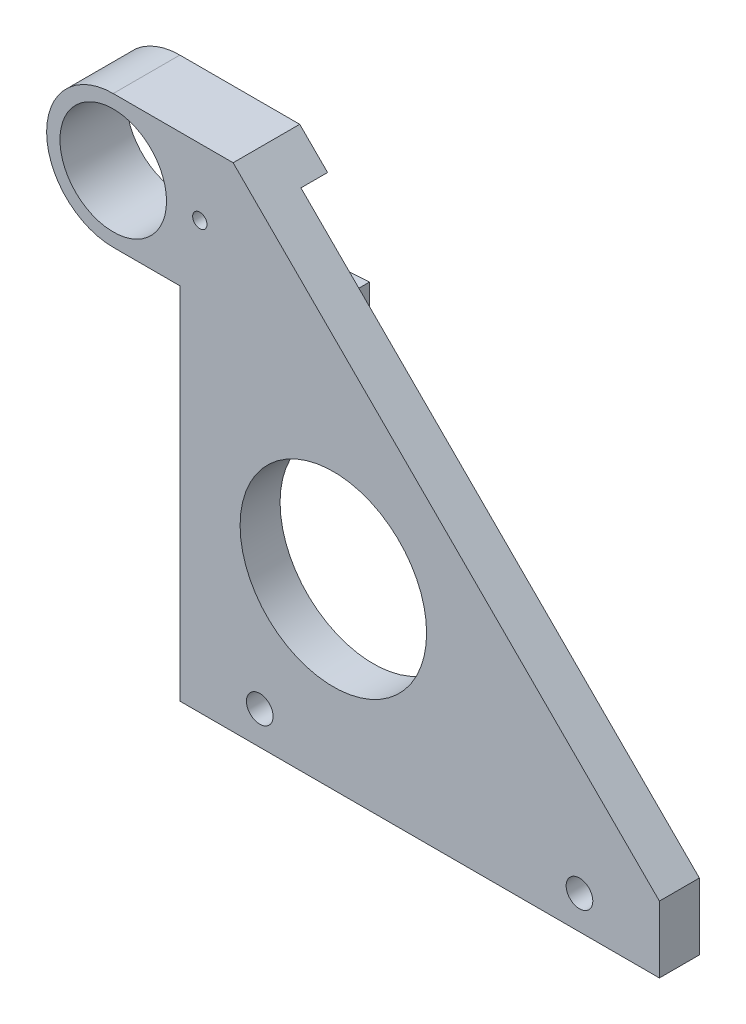
ISO-10303-21;
HEADER;
FILE_DESCRIPTION(('STEP AP214'),'2;1');
FILE_NAME('part.step','',(''),(''),'','','');
FILE_SCHEMA(('AUTOMOTIVE_DESIGN { 1 0 10303 214 1 1 1 1 }'));
ENDSEC;
DATA;
#1=APPLICATION_CONTEXT('core data for automotive mechanical design processes');
#2=APPLICATION_PROTOCOL_DEFINITION('international standard','automotive_design',2000,#1);
#3=PRODUCT_CONTEXT('',#1,'mechanical');
#4=PRODUCT('Part','Part','',(#3));
#5=PRODUCT_RELATED_PRODUCT_CATEGORY('part','',(#4));
#6=PRODUCT_DEFINITION_FORMATION('','',#4);
#7=PRODUCT_DEFINITION_CONTEXT('part definition',#1,'design');
#8=PRODUCT_DEFINITION('design','',#6,#7);
#9=PRODUCT_DEFINITION_SHAPE('','',#8);
#10=(LENGTH_UNIT() NAMED_UNIT(*) SI_UNIT(.MILLI.,.METRE.));
#11=(NAMED_UNIT(*) PLANE_ANGLE_UNIT() SI_UNIT($,.RADIAN.));
#12=(NAMED_UNIT(*) SI_UNIT($,.STERADIAN.) SOLID_ANGLE_UNIT());
#13=UNCERTAINTY_MEASURE_WITH_UNIT(LENGTH_MEASURE(1.E-05),#10,'distance_accuracy_value','');
#14=(GEOMETRIC_REPRESENTATION_CONTEXT(3) GLOBAL_UNCERTAINTY_ASSIGNED_CONTEXT((#13)) GLOBAL_UNIT_ASSIGNED_CONTEXT((#10,
#11,#12)) REPRESENTATION_CONTEXT('',''));
#15=CARTESIAN_POINT('',(0.,0.,0.));
#16=DIRECTION('',(0.,0.,1.));
#17=DIRECTION('',(1.,0.,0.));
#18=AXIS2_PLACEMENT_3D('',#15,#16,#17);
#19=CARTESIAN_POINT('',(12.,2.49999999999995,0.));
#20=DIRECTION('',(0.,0.,1.));
#21=DIRECTION('',(1.,0.,0.));
#22=AXIS2_PLACEMENT_3D('',#19,#20,#21);
#23=CYLINDRICAL_SURFACE('',#22,1.);
#24=CARTESIAN_POINT('',(12.,2.49999999999995,3.));
#25=DIRECTION('',(0.,0.,1.));
#26=DIRECTION('',(1.,0.,0.));
#27=AXIS2_PLACEMENT_3D('',#24,#25,#26);
#28=CIRCLE('',#27,1.);
#29=CARTESIAN_POINT('',(13.,2.49999999999995,3.));
#30=VERTEX_POINT('',#29);
#31=EDGE_CURVE('E178',#30,#30,#28,.T.);
#32=ORIENTED_EDGE('',*,*,#31,.T.);
#33=EDGE_LOOP('',(#32));
#34=FACE_BOUND('',#33,.T.);
#35=CARTESIAN_POINT('',(12.,2.49999999999995,1.5));
#36=DIRECTION('',(0.,0.,-1.));
#37=DIRECTION('',(-1.,0.,0.));
#38=AXIS2_PLACEMENT_3D('',#35,#36,#37);
#39=CIRCLE('',#38,1.);
#40=CARTESIAN_POINT('',(11.,2.49999999999995,1.5));
#41=VERTEX_POINT('',#40);
#42=EDGE_CURVE('E42',#41,#41,#39,.F.);
#43=ORIENTED_EDGE('',*,*,#42,.F.);
#44=EDGE_LOOP('',(#43));
#45=FACE_BOUND('',#44,.T.);
#46=ADVANCED_FACE('F37',(#34,#45),#23,.F.);
#47=CARTESIAN_POINT('',(-12.,2.49999999999995,0.));
#48=DIRECTION('',(0.,0.,1.));
#49=DIRECTION('',(1.,0.,0.));
#50=AXIS2_PLACEMENT_3D('',#47,#48,#49);
#51=CYLINDRICAL_SURFACE('',#50,1.);
#52=CARTESIAN_POINT('',(-12.,2.49999999999995,3.));
#53=DIRECTION('',(0.,0.,1.));
#54=DIRECTION('',(-1.,0.,0.));
#55=AXIS2_PLACEMENT_3D('',#52,#53,#54);
#56=CIRCLE('',#55,1.);
#57=CARTESIAN_POINT('',(-13.,2.49999999999995,3.));
#58=VERTEX_POINT('',#57);
#59=EDGE_CURVE('E175',#58,#58,#56,.T.);
#60=ORIENTED_EDGE('',*,*,#59,.T.);
#61=EDGE_LOOP('',(#60));
#62=FACE_BOUND('',#61,.T.);
#63=CARTESIAN_POINT('',(-12.,2.49999999999995,1.5));
#64=DIRECTION('',(0.,0.,-1.));
#65=DIRECTION('',(-1.,0.,0.));
#66=AXIS2_PLACEMENT_3D('',#63,#64,#65);
#67=CIRCLE('',#66,1.);
#68=CARTESIAN_POINT('',(-13.,2.49999999999995,1.5));
#69=VERTEX_POINT('',#68);
#70=EDGE_CURVE('E226',#69,#69,#67,.F.);
#71=ORIENTED_EDGE('',*,*,#70,.F.);
#72=EDGE_LOOP('',(#71));
#73=FACE_BOUND('',#72,.T.);
#74=ADVANCED_FACE('F294',(#62,#73),#51,.F.);
#75=CARTESIAN_POINT('',(-23.,32.,0.));
#76=DIRECTION('',(0.,0.,-1.));
#77=DIRECTION('',(-1.,0.,0.));
#78=AXIS2_PLACEMENT_3D('',#75,#76,#77);
#79=CYLINDRICAL_SURFACE('',#78,5.);
#80=DIRECTION('',(0.,0.,-1.));
#81=VECTOR('',#80,1.);
#82=CARTESIAN_POINT('',(-23.,37.,3.));
#83=LINE('',#82,#81);
#84=CARTESIAN_POINT('',(-23.,37.,-2.));
#85=VERTEX_POINT('',#84);
#86=CARTESIAN_POINT('',(-23.,37.,3.));
#87=VERTEX_POINT('',#86);
#88=EDGE_CURVE('E221',#85,#87,#83,.F.);
#89=ORIENTED_EDGE('',*,*,#88,.F.);
#90=CARTESIAN_POINT('',(-23.,32.,-2.));
#91=DIRECTION('',(0.,0.,-1.));
#92=DIRECTION('',(-1.,0.,0.));
#93=AXIS2_PLACEMENT_3D('',#90,#91,#92);
#94=CIRCLE('',#93,5.);
#95=CARTESIAN_POINT('',(-23.,27.,-2.));
#96=VERTEX_POINT('',#95);
#97=EDGE_CURVE('E157',#96,#85,#94,.T.);
#98=ORIENTED_EDGE('',*,*,#97,.F.);
#99=DIRECTION('',(0.,0.,-1.));
#100=VECTOR('',#99,1.);
#101=CARTESIAN_POINT('',(-23.,27.,3.));
#102=LINE('',#101,#100);
#103=CARTESIAN_POINT('',(-23.,27.,3.));
#104=VERTEX_POINT('',#103);
#105=EDGE_CURVE('E224',#104,#96,#102,.T.);
#106=ORIENTED_EDGE('',*,*,#105,.F.);
#107=CARTESIAN_POINT('',(-23.,32.,3.));
#108=DIRECTION('',(0.,0.,-1.));
#109=DIRECTION('',(-1.,0.,0.));
#110=AXIS2_PLACEMENT_3D('',#107,#108,#109);
#111=CIRCLE('',#110,5.);
#112=EDGE_CURVE('E47',#87,#104,#111,.F.);
#113=ORIENTED_EDGE('',*,*,#112,.F.);
#114=EDGE_LOOP('',(#89,#98,#106,#113));
#115=FACE_BOUND('',#114,.T.);
#116=ADVANCED_FACE('F40',(#115),#79,.T.);
#117=CARTESIAN_POINT('',(-28.,27.,3.));
#118=DIRECTION('',(0.,1.,0.));
#119=DIRECTION('',(-1.,0.,0.));
#120=AXIS2_PLACEMENT_3D('',#117,#118,#119);
#121=PLANE('',#120);
#122=DIRECTION('',(1.,0.,0.));
#123=VECTOR('',#122,1.);
#124=CARTESIAN_POINT('',(-28.,27.,3.));
#125=LINE('',#124,#123);
#126=CARTESIAN_POINT('',(-18.,27.,3.));
#127=VERTEX_POINT('',#126);
#128=EDGE_CURVE('E188',#104,#127,#125,.T.);
#129=ORIENTED_EDGE('',*,*,#128,.F.);
#130=ORIENTED_EDGE('',*,*,#105,.T.);
#131=DIRECTION('',(-1.,0.,0.));
#132=VECTOR('',#131,1.);
#133=CARTESIAN_POINT('',(-8.76991650325981,27.,-2.));
#134=LINE('',#133,#132);
#135=CARTESIAN_POINT('',(-8.76991650325981,27.,-2.));
#136=VERTEX_POINT('',#135);
#137=EDGE_CURVE('E167',#136,#96,#134,.T.);
#138=ORIENTED_EDGE('',*,*,#137,.F.);
#139=DIRECTION('',(0.,0.,1.));
#140=VECTOR('',#139,1.);
#141=CARTESIAN_POINT('',(-8.76991650325981,27.,-2.));
#142=LINE('',#141,#140);
#143=CARTESIAN_POINT('',(-8.76991650325981,27.,0.));
#144=VERTEX_POINT('',#143);
#145=EDGE_CURVE('E169',#136,#144,#142,.T.);
#146=ORIENTED_EDGE('',*,*,#145,.T.);
#147=DIRECTION('',(-1.,0.,0.));
#148=VECTOR('',#147,1.);
#149=CARTESIAN_POINT('',(-8.76991650325981,27.,0.));
#150=LINE('',#149,#148);
#151=CARTESIAN_POINT('',(-18.,27.,0.));
#152=VERTEX_POINT('',#151);
#153=EDGE_CURVE('E149',#144,#152,#150,.T.);
#154=ORIENTED_EDGE('',*,*,#153,.T.);
#155=DIRECTION('',(0.,0.,-1.));
#156=VECTOR('',#155,1.);
#157=CARTESIAN_POINT('',(-18.,27.,3.));
#158=LINE('',#157,#156);
#159=EDGE_CURVE('E218',#127,#152,#158,.T.);
#160=ORIENTED_EDGE('',*,*,#159,.F.);
#161=EDGE_LOOP('',(#129,#130,#138,#146,#154,#160));
#162=FACE_BOUND('',#161,.T.);
#163=ADVANCED_FACE('F328',(#162),#121,.F.);
#164=CARTESIAN_POINT('',(-18.,27.,3.));
#165=DIRECTION('',(1.,0.,0.));
#166=DIRECTION('',(0.,1.,0.));
#167=AXIS2_PLACEMENT_3D('',#164,#165,#166);
#168=PLANE('',#167);
#169=DIRECTION('',(0.,-1.,0.));
#170=VECTOR('',#169,1.);
#171=CARTESIAN_POINT('',(-18.,27.,0.));
#172=LINE('',#171,#170);
#173=CARTESIAN_POINT('',(-18.,0.,0.));
#174=VERTEX_POINT('',#173);
#175=EDGE_CURVE('E185',#152,#174,#172,.T.);
#176=ORIENTED_EDGE('',*,*,#175,.T.);
#177=DIRECTION('',(0.,0.,-1.));
#178=VECTOR('',#177,1.);
#179=CARTESIAN_POINT('',(-18.,0.,3.));
#180=LINE('',#179,#178);
#181=CARTESIAN_POINT('',(-18.,0.,3.));
#182=VERTEX_POINT('',#181);
#183=EDGE_CURVE('E215',#182,#174,#180,.T.);
#184=ORIENTED_EDGE('',*,*,#183,.F.);
#185=DIRECTION('',(0.,-1.,0.));
#186=VECTOR('',#185,1.);
#187=CARTESIAN_POINT('',(-18.,27.,3.));
#188=LINE('',#187,#186);
#189=EDGE_CURVE('E190',#127,#182,#188,.T.);
#190=ORIENTED_EDGE('',*,*,#189,.F.);
#191=ORIENTED_EDGE('',*,*,#159,.T.);
#192=EDGE_LOOP('',(#176,#184,#190,#191));
#193=FACE_BOUND('',#192,.T.);
#194=ADVANCED_FACE('F325',(#193),#168,.F.);
#195=CARTESIAN_POINT('',(-18.,0.,3.));
#196=DIRECTION('',(0.,1.,0.));
#197=DIRECTION('',(-1.,0.,0.));
#198=AXIS2_PLACEMENT_3D('',#195,#196,#197);
#199=PLANE('',#198);
#200=DIRECTION('',(1.,0.,0.));
#201=VECTOR('',#200,1.);
#202=CARTESIAN_POINT('',(-18.,0.,0.));
#203=LINE('',#202,#201);
#204=CARTESIAN_POINT('',(18.,0.,0.));
#205=VERTEX_POINT('',#204);
#206=EDGE_CURVE('E203',#174,#205,#203,.T.);
#207=ORIENTED_EDGE('',*,*,#206,.T.);
#208=DIRECTION('',(0.,0.,-1.));
#209=VECTOR('',#208,1.);
#210=CARTESIAN_POINT('',(18.,0.,3.));
#211=LINE('',#210,#209);
#212=CARTESIAN_POINT('',(18.,0.,3.));
#213=VERTEX_POINT('',#212);
#214=EDGE_CURVE('E212',#213,#205,#211,.T.);
#215=ORIENTED_EDGE('',*,*,#214,.F.);
#216=DIRECTION('',(1.,0.,0.));
#217=VECTOR('',#216,1.);
#218=CARTESIAN_POINT('',(-18.,0.,3.));
#219=LINE('',#218,#217);
#220=EDGE_CURVE('E193',#182,#213,#219,.T.);
#221=ORIENTED_EDGE('',*,*,#220,.F.);
#222=ORIENTED_EDGE('',*,*,#183,.T.);
#223=EDGE_LOOP('',(#207,#215,#221,#222));
#224=FACE_BOUND('',#223,.T.);
#225=ADVANCED_FACE('F322',(#224),#199,.F.);
#226=CARTESIAN_POINT('',(18.,0.,3.));
#227=DIRECTION('',(-1.,0.,0.));
#228=DIRECTION('',(0.,0.,1.));
#229=AXIS2_PLACEMENT_3D('',#226,#227,#228);
#230=PLANE('',#229);
#231=DIRECTION('',(0.,1.,0.));
#232=VECTOR('',#231,1.);
#233=CARTESIAN_POINT('',(18.,0.,0.));
#234=LINE('',#233,#232);
#235=CARTESIAN_POINT('',(18.,5.00000000000001,0.));
#236=VERTEX_POINT('',#235);
#237=EDGE_CURVE('E205',#205,#236,#234,.T.);
#238=ORIENTED_EDGE('',*,*,#237,.T.);
#239=DIRECTION('',(0.,0.,-1.));
#240=VECTOR('',#239,1.);
#241=CARTESIAN_POINT('',(18.,5.00000000000001,3.));
#242=LINE('',#241,#240);
#243=CARTESIAN_POINT('',(18.,5.00000000000001,3.));
#244=VERTEX_POINT('',#243);
#245=EDGE_CURVE('E209',#244,#236,#242,.T.);
#246=ORIENTED_EDGE('',*,*,#245,.F.);
#247=DIRECTION('',(0.,1.,0.));
#248=VECTOR('',#247,1.);
#249=CARTESIAN_POINT('',(18.,0.,3.));
#250=LINE('',#249,#248);
#251=EDGE_CURVE('E195',#213,#244,#250,.T.);
#252=ORIENTED_EDGE('',*,*,#251,.F.);
#253=ORIENTED_EDGE('',*,*,#214,.T.);
#254=EDGE_LOOP('',(#238,#246,#252,#253));
#255=FACE_BOUND('',#254,.T.);
#256=ADVANCED_FACE('F277',(#255),#230,.F.);
#257=CARTESIAN_POINT('',(18.,5.00000000000001,3.));
#258=DIRECTION('',(-0.707106781186549,-0.707106781186547,0.));
#259=DIRECTION('',(0.707106781186547,-0.707106781186549,0.));
#260=AXIS2_PLACEMENT_3D('',#257,#258,#259);
#261=PLANE('',#260);
#262=DIRECTION('',(-0.707106781186546,0.707106781186548,0.));
#263=VECTOR('',#262,1.);
#264=CARTESIAN_POINT('',(18.,5.00000000000001,0.));
#265=LINE('',#264,#263);
#266=CARTESIAN_POINT('',(-11.9097305394792,34.9097305394793,0.));
#267=VERTEX_POINT('',#266);
#268=EDGE_CURVE('E191',#236,#267,#265,.T.);
#269=ORIENTED_EDGE('',*,*,#268,.T.);
#270=DIRECTION('',(0.,0.,-1.));
#271=VECTOR('',#270,1.);
#272=CARTESIAN_POINT('',(-11.9097305394792,34.9097305394793,3.));
#273=LINE('',#272,#271);
#274=CARTESIAN_POINT('',(-11.9097305394792,34.9097305394793,-2.));
#275=VERTEX_POINT('',#274);
#276=EDGE_CURVE('E152',#267,#275,#273,.T.);
#277=ORIENTED_EDGE('',*,*,#276,.T.);
#278=DIRECTION('',(0.707106781186548,-0.707106781186548,0.));
#279=VECTOR('',#278,1.);
#280=CARTESIAN_POINT('',(-13.9999999999999,37.,-2.));
#281=LINE('',#280,#279);
#282=CARTESIAN_POINT('',(-13.9999999999999,37.,-2.));
#283=VERTEX_POINT('',#282);
#284=EDGE_CURVE('E163',#283,#275,#281,.T.);
#285=ORIENTED_EDGE('',*,*,#284,.F.);
#286=DIRECTION('',(0.,0.,-1.));
#287=VECTOR('',#286,1.);
#288=CARTESIAN_POINT('',(-13.9999999999999,37.,3.));
#289=LINE('',#288,#287);
#290=CARTESIAN_POINT('',(-13.9999999999999,37.,3.));
#291=VERTEX_POINT('',#290);
#292=EDGE_CURVE('E201',#291,#283,#289,.T.);
#293=ORIENTED_EDGE('',*,*,#292,.F.);
#294=DIRECTION('',(-0.707106781186546,0.707106781186548,0.));
#295=VECTOR('',#294,1.);
#296=CARTESIAN_POINT('',(18.,5.00000000000001,3.));
#297=LINE('',#296,#295);
#298=EDGE_CURVE('E197',#244,#291,#297,.T.);
#299=ORIENTED_EDGE('',*,*,#298,.F.);
#300=ORIENTED_EDGE('',*,*,#245,.T.);
#301=EDGE_LOOP('',(#269,#277,#285,#293,#299,#300));
#302=FACE_BOUND('',#301,.T.);
#303=ADVANCED_FACE('F260',(#302),#261,.F.);
#304=CARTESIAN_POINT('',(-13.9999999999999,37.,3.));
#305=DIRECTION('',(0.,-1.,0.));
#306=DIRECTION('',(1.,0.,0.));
#307=AXIS2_PLACEMENT_3D('',#304,#305,#306);
#308=PLANE('',#307);
#309=ORIENTED_EDGE('',*,*,#292,.T.);
#310=DIRECTION('',(1.,0.,0.));
#311=VECTOR('',#310,1.);
#312=CARTESIAN_POINT('',(-23.,37.,-2.));
#313=LINE('',#312,#311);
#314=EDGE_CURVE('E160',#85,#283,#313,.T.);
#315=ORIENTED_EDGE('',*,*,#314,.F.);
#316=ORIENTED_EDGE('',*,*,#88,.T.);
#317=DIRECTION('',(-1.,0.,0.));
#318=VECTOR('',#317,1.);
#319=CARTESIAN_POINT('',(-13.9999999999999,37.,3.));
#320=LINE('',#319,#318);
#321=EDGE_CURVE('E199',#291,#87,#320,.T.);
#322=ORIENTED_EDGE('',*,*,#321,.F.);
#323=EDGE_LOOP('',(#309,#315,#316,#322));
#324=FACE_BOUND('',#323,.T.);
#325=ADVANCED_FACE('F268',(#324),#308,.F.);
#326=CARTESIAN_POINT('',(0.,0.,3.));
#327=DIRECTION('',(0.,0.,-1.));
#328=DIRECTION('',(-1.,0.,0.));
#329=AXIS2_PLACEMENT_3D('',#326,#327,#328);
#330=PLANE('',#329);
#331=CARTESIAN_POINT('',(-16.5,32.,3.));
#332=DIRECTION('',(0.,0.,-1.));
#333=DIRECTION('',(-1.,0.,0.));
#334=AXIS2_PLACEMENT_3D('',#331,#332,#333);
#335=CIRCLE('',#334,0.53714125745292);
#336=CARTESIAN_POINT('',(-17.0371412574529,32.,3.));
#337=VERTEX_POINT('',#336);
#338=EDGE_CURVE('E233',#337,#337,#335,.T.);
#339=ORIENTED_EDGE('',*,*,#338,.T.);
#340=EDGE_LOOP('',(#339));
#341=FACE_BOUND('',#340,.T.);
#342=CARTESIAN_POINT('',(-23.,32.,3.));
#343=DIRECTION('',(0.,0.,1.));
#344=DIRECTION('',(1.,0.,0.));
#345=AXIS2_PLACEMENT_3D('',#342,#343,#344);
#346=CIRCLE('',#345,4.);
#347=CARTESIAN_POINT('',(-19.,32.,3.));
#348=VERTEX_POINT('',#347);
#349=EDGE_CURVE('E147',#348,#348,#346,.T.);
#350=ORIENTED_EDGE('',*,*,#349,.F.);
#351=EDGE_LOOP('',(#350));
#352=FACE_BOUND('',#351,.T.);
#353=ORIENTED_EDGE('',*,*,#59,.F.);
#354=EDGE_LOOP('',(#353));
#355=FACE_BOUND('',#354,.T.);
#356=ORIENTED_EDGE('',*,*,#31,.F.);
#357=EDGE_LOOP('',(#356));
#358=FACE_BOUND('',#357,.T.);
#359=CARTESIAN_POINT('',(-6.47635753390574,13.6875392105491,3.));
#360=DIRECTION('',(0.,0.,1.));
#361=DIRECTION('',(1.,0.,0.));
#362=AXIS2_PLACEMENT_3D('',#359,#360,#361);
#363=CIRCLE('',#362,7.);
#364=CARTESIAN_POINT('',(0.523642466094258,13.6875392105491,3.));
#365=VERTEX_POINT('',#364);
#366=EDGE_CURVE('E181',#365,#365,#363,.T.);
#367=ORIENTED_EDGE('',*,*,#366,.F.);
#368=EDGE_LOOP('',(#367));
#369=FACE_BOUND('',#368,.T.);
#370=ORIENTED_EDGE('',*,*,#321,.T.);
#371=ORIENTED_EDGE('',*,*,#112,.T.);
#372=ORIENTED_EDGE('',*,*,#128,.T.);
#373=ORIENTED_EDGE('',*,*,#189,.T.);
#374=ORIENTED_EDGE('',*,*,#220,.T.);
#375=ORIENTED_EDGE('',*,*,#251,.T.);
#376=ORIENTED_EDGE('',*,*,#298,.T.);
#377=EDGE_LOOP('',(#370,#371,#372,#373,#374,#375,#376));
#378=FACE_BOUND('',#377,.T.);
#379=ADVANCED_FACE('F272',(#341,#352,#355,#358,#369,#378),#330,.F.);
#380=CARTESIAN_POINT('',(0.,0.,0.));
#381=DIRECTION('',(0.,0.,-1.));
#382=DIRECTION('',(-1.,0.,0.));
#383=AXIS2_PLACEMENT_3D('',#380,#381,#382);
#384=PLANE('',#383);
#385=CARTESIAN_POINT('',(12.,2.49999999999995,0.));
#386=DIRECTION('',(0.,0.,-1.));
#387=DIRECTION('',(-1.,0.,0.));
#388=AXIS2_PLACEMENT_3D('',#385,#386,#387);
#389=CIRCLE('',#388,1.85);
#390=CARTESIAN_POINT('',(10.15,2.49999999999995,0.));
#391=VERTEX_POINT('',#390);
#392=EDGE_CURVE('E243',#391,#391,#389,.T.);
#393=ORIENTED_EDGE('',*,*,#392,.F.);
#394=EDGE_LOOP('',(#393));
#395=FACE_BOUND('',#394,.T.);
#396=CARTESIAN_POINT('',(-12.,2.49999999999995,0.));
#397=DIRECTION('',(0.,0.,-1.));
#398=DIRECTION('',(-1.,0.,0.));
#399=AXIS2_PLACEMENT_3D('',#396,#397,#398);
#400=CIRCLE('',#399,1.85);
#401=CARTESIAN_POINT('',(-13.85,2.49999999999995,0.));
#402=VERTEX_POINT('',#401);
#403=EDGE_CURVE('E236',#402,#402,#400,.T.);
#404=ORIENTED_EDGE('',*,*,#403,.F.);
#405=EDGE_LOOP('',(#404));
#406=FACE_BOUND('',#405,.T.);
#407=CARTESIAN_POINT('',(-16.5,32.,0.));
#408=DIRECTION('',(0.,0.,-1.));
#409=DIRECTION('',(-1.,0.,0.));
#410=AXIS2_PLACEMENT_3D('',#407,#408,#409);
#411=CIRCLE('',#410,0.53714125745292);
#412=CARTESIAN_POINT('',(-17.0371412574529,32.,0.));
#413=VERTEX_POINT('',#412);
#414=EDGE_CURVE('E228',#413,#413,#411,.T.);
#415=ORIENTED_EDGE('',*,*,#414,.F.);
#416=EDGE_LOOP('',(#415));
#417=FACE_BOUND('',#416,.T.);
#418=DIRECTION('',(0.,-1.,0.));
#419=VECTOR('',#418,1.);
#420=CARTESIAN_POINT('',(-8.76991650325977,31.7699165032599,0.));
#421=LINE('',#420,#419);
#422=CARTESIAN_POINT('',(-8.76991650325979,29.3573561388861,0.));
#423=VERTEX_POINT('',#422);
#424=EDGE_CURVE('E146',#423,#144,#421,.T.);
#425=ORIENTED_EDGE('',*,*,#424,.F.);
#426=DIRECTION('',(0.997822540918993,0.0659558703525614,0.));
#427=VECTOR('',#426,1.);
#428=CARTESIAN_POINT('',(-20.9747127910058,28.5506215456861,0.));
#429=LINE('',#428,#427);
#430=CARTESIAN_POINT('',(-20.9747127910058,28.5506215456861,0.));
#431=VERTEX_POINT('',#430);
#432=EDGE_CURVE('E248',#431,#423,#429,.T.);
#433=ORIENTED_EDGE('',*,*,#432,.F.);
#434=CARTESIAN_POINT('',(-23.,32.,0.));
#435=DIRECTION('',(0.,0.,-1.));
#436=DIRECTION('',(-1.,0.,0.));
#437=AXIS2_PLACEMENT_3D('',#434,#435,#436);
#438=CIRCLE('',#437,4.);
#439=CARTESIAN_POINT('',(-20.9747127910058,35.4493784543138,0.));
#440=VERTEX_POINT('',#439);
#441=EDGE_CURVE('E11',#431,#440,#438,.F.);
#442=ORIENTED_EDGE('',*,*,#441,.T.);
#443=DIRECTION('',(-0.998232722987987,0.05942584249289,0.));
#444=VECTOR('',#443,1.);
#445=CARTESIAN_POINT('',(-7.02133985441122,34.6187195074776,0.));
#446=LINE('',#445,#444);
#447=EDGE_CURVE('E250',#267,#440,#446,.T.);
#448=ORIENTED_EDGE('',*,*,#447,.F.);
#449=ORIENTED_EDGE('',*,*,#268,.F.);
#450=ORIENTED_EDGE('',*,*,#237,.F.);
#451=ORIENTED_EDGE('',*,*,#206,.F.);
#452=ORIENTED_EDGE('',*,*,#175,.F.);
#453=ORIENTED_EDGE('',*,*,#153,.F.);
#454=EDGE_LOOP('',(#425,#433,#442,#448,#449,#450,#451,#452,#453));
#455=FACE_BOUND('',#454,.T.);
#456=CARTESIAN_POINT('',(-6.47635753390574,13.6875392105491,0.));
#457=DIRECTION('',(0.,0.,1.));
#458=DIRECTION('',(1.,0.,0.));
#459=AXIS2_PLACEMENT_3D('',#456,#457,#458);
#460=CIRCLE('',#459,7.);
#461=CARTESIAN_POINT('',(0.523642466094258,13.6875392105491,0.));
#462=VERTEX_POINT('',#461);
#463=EDGE_CURVE('E182',#462,#462,#460,.T.);
#464=ORIENTED_EDGE('',*,*,#463,.T.);
#465=EDGE_LOOP('',(#464));
#466=FACE_BOUND('',#465,.T.);
#467=ADVANCED_FACE('F281',(#395,#406,#417,#455,#466),#384,.T.);
#468=CARTESIAN_POINT('',(-6.47635753390574,13.6875392105491,0.));
#469=DIRECTION('',(0.,0.,1.));
#470=DIRECTION('',(1.,0.,0.));
#471=AXIS2_PLACEMENT_3D('',#468,#469,#470);
#472=CYLINDRICAL_SURFACE('',#471,7.);
#473=ORIENTED_EDGE('',*,*,#463,.F.);
#474=EDGE_LOOP('',(#473));
#475=FACE_BOUND('',#474,.T.);
#476=ORIENTED_EDGE('',*,*,#366,.T.);
#477=EDGE_LOOP('',(#476));
#478=FACE_BOUND('',#477,.T.);
#479=ADVANCED_FACE('F305',(#475,#478),#472,.F.);
#480=CARTESIAN_POINT('',(-8.76991650325977,31.7699165032599,-2.));
#481=DIRECTION('',(-1.,0.,0.));
#482=DIRECTION('',(0.,-1.,0.));
#483=AXIS2_PLACEMENT_3D('',#480,#481,#482);
#484=PLANE('',#483);
#485=DIRECTION('',(0.,-1.,0.));
#486=VECTOR('',#485,1.);
#487=CARTESIAN_POINT('',(-8.76991650325977,31.7699165032599,-2.));
#488=LINE('',#487,#486);
#489=CARTESIAN_POINT('',(-8.76991650325977,29.3573561388861,-2.));
#490=VERTEX_POINT('',#489);
#491=EDGE_CURVE('E165',#490,#136,#488,.T.);
#492=ORIENTED_EDGE('',*,*,#491,.F.);
#493=DIRECTION('',(0.,0.,1.));
#494=VECTOR('',#493,1.);
#495=CARTESIAN_POINT('',(-8.76991650325979,29.3573561388861,-2.));
#496=LINE('',#495,#494);
#497=EDGE_CURVE('E128',#490,#423,#496,.T.);
#498=ORIENTED_EDGE('',*,*,#497,.T.);
#499=ORIENTED_EDGE('',*,*,#424,.T.);
#500=ORIENTED_EDGE('',*,*,#145,.F.);
#501=EDGE_LOOP('',(#492,#498,#499,#500));
#502=FACE_BOUND('',#501,.T.);
#503=ADVANCED_FACE('F308',(#502),#484,.F.);
#504=CARTESIAN_POINT('',(-23.,32.,-2.));
#505=DIRECTION('',(0.,0.,-1.));
#506=DIRECTION('',(-1.,0.,0.));
#507=AXIS2_PLACEMENT_3D('',#504,#505,#506);
#508=PLANE('',#507);
#509=DIRECTION('',(0.998232722987986,-0.05942584249289,0.));
#510=VECTOR('',#509,1.);
#511=CARTESIAN_POINT('',(-7.02133985441122,34.6187195074776,-2.));
#512=LINE('',#511,#510);
#513=CARTESIAN_POINT('',(-20.9747127910058,35.4493784543138,-2.));
#514=VERTEX_POINT('',#513);
#515=EDGE_CURVE('E132',#514,#275,#512,.T.);
#516=ORIENTED_EDGE('',*,*,#515,.F.);
#517=CARTESIAN_POINT('',(-23.,32.,-2.));
#518=DIRECTION('',(0.,0.,1.));
#519=DIRECTION('',(1.,0.,0.));
#520=AXIS2_PLACEMENT_3D('',#517,#518,#519);
#521=CIRCLE('',#520,4.);
#522=CARTESIAN_POINT('',(-20.9747127910058,28.5506215456861,-2.));
#523=VERTEX_POINT('',#522);
#524=EDGE_CURVE('E140',#514,#523,#521,.T.);
#525=ORIENTED_EDGE('',*,*,#524,.T.);
#526=DIRECTION('',(-0.997822540918993,-0.0659558703525614,0.));
#527=VECTOR('',#526,1.);
#528=CARTESIAN_POINT('',(-20.9747127910058,28.5506215456861,-2.));
#529=LINE('',#528,#527);
#530=EDGE_CURVE('E125',#490,#523,#529,.T.);
#531=ORIENTED_EDGE('',*,*,#530,.F.);
#532=ORIENTED_EDGE('',*,*,#491,.T.);
#533=ORIENTED_EDGE('',*,*,#137,.T.);
#534=ORIENTED_EDGE('',*,*,#97,.T.);
#535=ORIENTED_EDGE('',*,*,#314,.T.);
#536=ORIENTED_EDGE('',*,*,#284,.T.);
#537=EDGE_LOOP('',(#516,#525,#531,#532,#533,#534,#535,#536));
#538=FACE_BOUND('',#537,.T.);
#539=ADVANCED_FACE('F144',(#538),#508,.T.);
#540=CARTESIAN_POINT('',(-23.,32.,-2.));
#541=DIRECTION('',(0.,0.,1.));
#542=DIRECTION('',(1.,0.,0.));
#543=AXIS2_PLACEMENT_3D('',#540,#541,#542);
#544=CYLINDRICAL_SURFACE('',#543,4.);
#545=ORIENTED_EDGE('',*,*,#524,.F.);
#546=DIRECTION('',(0.,0.,-1.));
#547=VECTOR('',#546,1.);
#548=CARTESIAN_POINT('',(-20.9747127910058,35.4493784543138,15.5656501050238));
#549=LINE('',#548,#547);
#550=EDGE_CURVE('E141',#440,#514,#549,.T.);
#551=ORIENTED_EDGE('',*,*,#550,.F.);
#552=ORIENTED_EDGE('',*,*,#441,.F.);
#553=DIRECTION('',(0.,0.,-1.));
#554=VECTOR('',#553,1.);
#555=CARTESIAN_POINT('',(-20.9747127910058,28.5506215456861,15.5656501050238));
#556=LINE('',#555,#554);
#557=EDGE_CURVE('E55',#431,#523,#556,.T.);
#558=ORIENTED_EDGE('',*,*,#557,.T.);
#559=EDGE_LOOP('',(#545,#551,#552,#558));
#560=FACE_BOUND('',#559,.T.);
#561=ORIENTED_EDGE('',*,*,#349,.T.);
#562=EDGE_LOOP('',(#561));
#563=FACE_BOUND('',#562,.T.);
#564=ADVANCED_FACE('F137',(#560,#563),#544,.F.);
#565=CARTESIAN_POINT('',(-7.02133985441122,34.6187195074776,15.5656501050238));
#566=DIRECTION('',(0.05942584249289,0.998232722987986,0.));
#567=DIRECTION('',(-0.998232722987987,0.05942584249289,0.));
#568=AXIS2_PLACEMENT_3D('',#565,#566,#567);
#569=PLANE('',#568);
#570=ORIENTED_EDGE('',*,*,#447,.T.);
#571=ORIENTED_EDGE('',*,*,#550,.T.);
#572=ORIENTED_EDGE('',*,*,#515,.T.);
#573=ORIENTED_EDGE('',*,*,#276,.F.);
#574=EDGE_LOOP('',(#570,#571,#572,#573));
#575=FACE_BOUND('',#574,.T.);
#576=ADVANCED_FACE('F283',(#575),#569,.F.);
#577=CARTESIAN_POINT('',(-20.9747127910058,28.5506215456861,15.5656501050238));
#578=DIRECTION('',(0.0659558703525614,-0.997822540918993,0.));
#579=DIRECTION('',(0.997822540918993,0.0659558703525614,0.));
#580=AXIS2_PLACEMENT_3D('',#577,#578,#579);
#581=PLANE('',#580);
#582=ORIENTED_EDGE('',*,*,#530,.T.);
#583=ORIENTED_EDGE('',*,*,#557,.F.);
#584=ORIENTED_EDGE('',*,*,#432,.T.);
#585=ORIENTED_EDGE('',*,*,#497,.F.);
#586=EDGE_LOOP('',(#582,#583,#584,#585));
#587=FACE_BOUND('',#586,.T.);
#588=ADVANCED_FACE('F126',(#587),#581,.F.);
#589=CARTESIAN_POINT('',(-16.5,32.,3.));
#590=DIRECTION('',(0.,0.,-1.));
#591=DIRECTION('',(-1.,0.,0.));
#592=AXIS2_PLACEMENT_3D('',#589,#590,#591);
#593=CYLINDRICAL_SURFACE('',#592,0.53714125745292);
#594=ORIENTED_EDGE('',*,*,#338,.F.);
#595=EDGE_LOOP('',(#594));
#596=FACE_BOUND('',#595,.T.);
#597=ORIENTED_EDGE('',*,*,#414,.T.);
#598=EDGE_LOOP('',(#597));
#599=FACE_BOUND('',#598,.T.);
#600=ADVANCED_FACE('F290',(#596,#599),#593,.F.);
#601=CARTESIAN_POINT('',(-12.,2.49999999999995,1.5));
#602=DIRECTION('',(0.,0.,-1.));
#603=DIRECTION('',(-1.,0.,0.));
#604=AXIS2_PLACEMENT_3D('',#601,#602,#603);
#605=PLANE('',#604);
#606=CARTESIAN_POINT('',(-12.,2.49999999999995,1.5));
#607=DIRECTION('',(0.,0.,-1.));
#608=DIRECTION('',(-1.,0.,0.));
#609=AXIS2_PLACEMENT_3D('',#606,#607,#608);
#610=CIRCLE('',#609,1.85);
#611=CARTESIAN_POINT('',(-13.85,2.49999999999995,1.5));
#612=VERTEX_POINT('',#611);
#613=EDGE_CURVE('E229',#612,#612,#610,.T.);
#614=ORIENTED_EDGE('',*,*,#613,.T.);
#615=EDGE_LOOP('',(#614));
#616=FACE_BOUND('',#615,.T.);
#617=ORIENTED_EDGE('',*,*,#70,.T.);
#618=EDGE_LOOP('',(#617));
#619=FACE_BOUND('',#618,.T.);
#620=ADVANCED_FACE('F381',(#616,#619),#605,.T.);
#621=CARTESIAN_POINT('',(-12.,2.49999999999995,1.5));
#622=DIRECTION('',(0.,0.,-1.));
#623=DIRECTION('',(-1.,0.,0.));
#624=AXIS2_PLACEMENT_3D('',#621,#622,#623);
#625=CYLINDRICAL_SURFACE('',#624,1.85);
#626=ORIENTED_EDGE('',*,*,#613,.F.);
#627=EDGE_LOOP('',(#626));
#628=FACE_BOUND('',#627,.T.);
#629=ORIENTED_EDGE('',*,*,#403,.T.);
#630=EDGE_LOOP('',(#629));
#631=FACE_BOUND('',#630,.T.);
#632=ADVANCED_FACE('F407',(#628,#631),#625,.F.);
#633=CARTESIAN_POINT('',(12.,2.49999999999995,1.5));
#634=DIRECTION('',(0.,0.,-1.));
#635=DIRECTION('',(-1.,0.,0.));
#636=AXIS2_PLACEMENT_3D('',#633,#634,#635);
#637=PLANE('',#636);
#638=CARTESIAN_POINT('',(12.,2.49999999999995,1.5));
#639=DIRECTION('',(0.,0.,-1.));
#640=DIRECTION('',(-1.,0.,0.));
#641=AXIS2_PLACEMENT_3D('',#638,#639,#640);
#642=CIRCLE('',#641,1.85);
#643=CARTESIAN_POINT('',(10.15,2.49999999999995,1.5));
#644=VERTEX_POINT('',#643);
#645=EDGE_CURVE('E443',#644,#644,#642,.T.);
#646=ORIENTED_EDGE('',*,*,#645,.T.);
#647=EDGE_LOOP('',(#646));
#648=FACE_BOUND('',#647,.T.);
#649=ORIENTED_EDGE('',*,*,#42,.T.);
#650=EDGE_LOOP('',(#649));
#651=FACE_BOUND('',#650,.T.);
#652=ADVANCED_FACE('F416',(#648,#651),#637,.T.);
#653=CARTESIAN_POINT('',(12.,2.49999999999995,1.5));
#654=DIRECTION('',(0.,0.,-1.));
#655=DIRECTION('',(-1.,0.,0.));
#656=AXIS2_PLACEMENT_3D('',#653,#654,#655);
#657=CYLINDRICAL_SURFACE('',#656,1.85);
#658=ORIENTED_EDGE('',*,*,#645,.F.);
#659=EDGE_LOOP('',(#658));
#660=FACE_BOUND('',#659,.T.);
#661=ORIENTED_EDGE('',*,*,#392,.T.);
#662=EDGE_LOOP('',(#661));
#663=FACE_BOUND('',#662,.T.);
#664=ADVANCED_FACE('F426',(#660,#663),#657,.F.);
#665=CLOSED_SHELL('',(#46,#74,#116,#163,#194,#225,#256,#303,#325,#379,#467,#479,#503,#539,#564,
#576,#588,#600,#620,#632,#652,#664));
#666=MANIFOLD_SOLID_BREP('B2',#665);
#667=ADVANCED_BREP_SHAPE_REPRESENTATION('',(#18,#666),#14);
#668=SHAPE_DEFINITION_REPRESENTATION(#9,#667);
ENDSEC;
END-ISO-10303-21;
